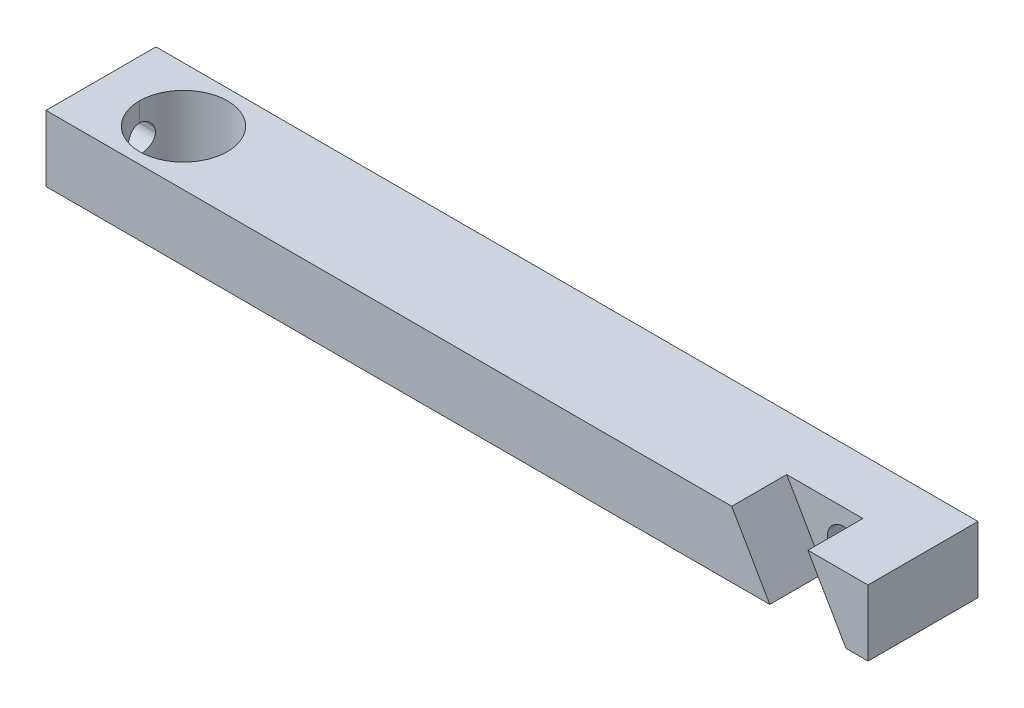
ISO-10303-21;
HEADER;
FILE_DESCRIPTION(('STEP AP214'),'2;1');
FILE_NAME('part.step','',(''),(''),'','','');
FILE_SCHEMA(('AUTOMOTIVE_DESIGN { 1 0 10303 214 1 1 1 1 }'));
ENDSEC;
DATA;
#1=APPLICATION_CONTEXT('core data for automotive mechanical design processes');
#2=APPLICATION_PROTOCOL_DEFINITION('international standard','automotive_design',2000,#1);
#3=PRODUCT_CONTEXT('',#1,'mechanical');
#4=PRODUCT('Part','Part','',(#3));
#5=PRODUCT_RELATED_PRODUCT_CATEGORY('part','',(#4));
#6=PRODUCT_DEFINITION_FORMATION('','',#4);
#7=PRODUCT_DEFINITION_CONTEXT('part definition',#1,'design');
#8=PRODUCT_DEFINITION('design','',#6,#7);
#9=PRODUCT_DEFINITION_SHAPE('','',#8);
#10=(LENGTH_UNIT() NAMED_UNIT(*) SI_UNIT(.MILLI.,.METRE.));
#11=(NAMED_UNIT(*) PLANE_ANGLE_UNIT() SI_UNIT($,.RADIAN.));
#12=(NAMED_UNIT(*) SI_UNIT($,.STERADIAN.) SOLID_ANGLE_UNIT());
#13=UNCERTAINTY_MEASURE_WITH_UNIT(LENGTH_MEASURE(1.E-05),#10,'distance_accuracy_value','');
#14=(GEOMETRIC_REPRESENTATION_CONTEXT(3) GLOBAL_UNCERTAINTY_ASSIGNED_CONTEXT((#13)) GLOBAL_UNIT_ASSIGNED_CONTEXT((#10,
#11,#12)) REPRESENTATION_CONTEXT('',''));
#15=CARTESIAN_POINT('',(0.,0.,0.));
#16=DIRECTION('',(0.,0.,1.));
#17=DIRECTION('',(1.,0.,0.));
#18=AXIS2_PLACEMENT_3D('',#15,#16,#17);
#19=CARTESIAN_POINT('',(-7.5,104.,0.));
#20=DIRECTION('',(-1.,0.,0.));
#21=DIRECTION('',(0.,0.,1.));
#22=AXIS2_PLACEMENT_3D('',#19,#20,#21);
#23=CYLINDRICAL_SURFACE('',#22,1.25);
#24=CARTESIAN_POINT('',(-3.79967103839265,104.,-1.25000000000006));
#25=CARTESIAN_POINT('',(-3.79967300010033,103.979341260387,-1.2499925708513));
#26=CARTESIAN_POINT('',(-3.79983884394613,103.95868174032,-1.24948985386808));
#27=CARTESIAN_POINT('',(-3.80049760968689,103.917548799479,-1.24748547221147));
#28=CARTESIAN_POINT('',(-3.80098843768822,103.897075032416,-1.24599020246324));
#29=CARTESIAN_POINT('',(-3.8022940161089,103.856313353297,-1.24200013711761));
#30=CARTESIAN_POINT('',(-3.80310753533987,103.836025031269,-1.23950914031696));
#31=CARTESIAN_POINT('',(-3.80505142907727,103.795634409207,-1.23352890468625));
#32=CARTESIAN_POINT('',(-3.80618145074405,103.775531927628,-1.23004077737704));
#33=CARTESIAN_POINT('',(-3.80874935096631,103.735512656155,-1.22206625232391));
#34=CARTESIAN_POINT('',(-3.81018771416554,103.715596210698,-1.21757828261102));
#35=CARTESIAN_POINT('',(-3.81336091401607,103.675948473343,-1.20760342483043));
#36=CARTESIAN_POINT('',(-3.81509698727552,103.656218331303,-1.20211236371523));
#37=CARTESIAN_POINT('',(-3.81885191390687,103.616942219289,-1.1901301356707));
#38=CARTESIAN_POINT('',(-3.82087262909034,103.597398447623,-1.18363235342774));
#39=CARTESIAN_POINT('',(-3.82518118032637,103.558494447965,-1.16963370611135));
#40=CARTESIAN_POINT('',(-3.82747134627348,103.539137666183,-1.16212399578106));
#41=CARTESIAN_POINT('',(-3.83223859227424,103.501093453789,-1.14630483516844));
#42=CARTESIAN_POINT('',(-3.83471266895294,103.482400479063,-1.13800780240955));
#43=CARTESIAN_POINT('',(-3.83984311093793,103.44555070139,-1.12057440414788));
#44=CARTESIAN_POINT('',(-3.84249850923293,103.42739169553,-1.11144241473838));
#45=CARTESIAN_POINT('',(-3.84797360685266,103.391609686806,-1.09233584826213));
#46=CARTESIAN_POINT('',(-3.85079286010734,103.373985410768,-1.0823635283374));
#47=CARTESIAN_POINT('',(-3.85657584993732,103.33927172477,-1.06157386987136));
#48=CARTESIAN_POINT('',(-3.85953955781485,103.322182209673,-1.05075669891546));
#49=CARTESIAN_POINT('',(-3.86559017597119,103.288536873349,-1.02827446889697));
#50=CARTESIAN_POINT('',(-3.86867734495555,103.271982320055,-1.01660758226925));
#51=CARTESIAN_POINT('',(-3.87495204760996,103.239405474988,-0.992422988343569));
#52=CARTESIAN_POINT('',(-3.8781399782165,103.223385987467,-0.979901608112887));
#53=CARTESIAN_POINT('',(-3.88459188088559,103.191877756538,-0.954004824991964));
#54=CARTESIAN_POINT('',(-3.88785622707684,103.176393466706,-0.940624099473873));
#55=CARTESIAN_POINT('',(-3.89443498392908,103.145953818187,-0.913005724083212));
#56=CARTESIAN_POINT('',(-3.89774957911118,103.131004618042,-0.898761336732451));
#57=CARTESIAN_POINT('',(-3.90434438423706,103.101887516861,-0.869664458525661));
#58=CARTESIAN_POINT('',(-3.90762468083549,103.087715430554,-0.854816175345123));
#59=CARTESIAN_POINT('',(-3.91412131112979,103.060207396074,-0.824555627320368));
#60=CARTESIAN_POINT('',(-3.91733793856455,103.046866034817,-0.809148351191602));
#61=CARTESIAN_POINT('',(-3.92368812600505,103.021018076423,-0.777770128703016));
#62=CARTESIAN_POINT('',(-3.92682203178346,103.008507488037,-0.761802541724582));
#63=CARTESIAN_POINT('',(-3.93298722793353,102.984319619556,-0.729303894259466));
#64=CARTESIAN_POINT('',(-3.93601879411345,102.972639986775,-0.712774637836716));
#65=CARTESIAN_POINT('',(-3.94195917123855,102.950112341238,-0.679153225803564));
#66=CARTESIAN_POINT('',(-3.94486806030892,102.939263795508,-0.662061441168576));
#67=CARTESIAN_POINT('',(-3.95054239439401,102.918396409674,-0.627315832002432));
#68=CARTESIAN_POINT('',(-3.95330759095591,102.908378989891,-0.609661113932547));
#69=CARTESIAN_POINT('',(-3.95867332617156,102.889172080618,-0.573790605432787));
#70=CARTESIAN_POINT('',(-3.96127316583386,102.879986044246,-0.555572861928062));
#71=CARTESIAN_POINT('',(-3.96628633104688,102.862439093146,-0.518578168673608));
#72=CARTESIAN_POINT('',(-3.96869839283406,102.854083679211,-0.499798440827462));
#73=CARTESIAN_POINT('',(-3.97331377317728,102.838199429806,-0.461681034696653));
#74=CARTESIAN_POINT('',(-3.97551518447484,102.830678063608,-0.442340010749169));
#75=CARTESIAN_POINT('',(-3.9796495131673,102.816646819788,-0.403446404549168));
#76=CARTESIAN_POINT('',(-3.98158448075439,102.810129166824,-0.383896849755154));
#77=CARTESIAN_POINT('',(-3.98517803286372,102.7981026555,-0.344591355548881));
#78=CARTESIAN_POINT('',(-3.98683817700261,102.792588085684,-0.324837307974689));
#79=CARTESIAN_POINT('',(-3.98987436007079,102.782565804875,-0.285127531885421));
#80=CARTESIAN_POINT('',(-3.99125137208636,102.77805464079,-0.265172750061727));
#81=CARTESIAN_POINT('',(-3.99371359822312,102.770036830846,-0.22506639917594));
#82=CARTESIAN_POINT('',(-3.99479911747207,102.766529134327,-0.204915058953864));
#83=CARTESIAN_POINT('',(-3.99667079219043,102.7605156922,-0.164420403740985));
#84=CARTESIAN_POINT('',(-3.99745652150937,102.758011372637,-0.1440768572851));
#85=CARTESIAN_POINT('',(-3.99872086524806,102.754002702518,-0.103202748122406));
#86=CARTESIAN_POINT('',(-3.99919827980915,102.752502257903,-0.0826717663878889));
#87=CARTESIAN_POINT('',(-3.99983913090932,102.750496928101,-0.0414271212798195));
#88=CARTESIAN_POINT('',(-4.0000005798885,102.74999834453,-0.0207131196596859));
#89=CARTESIAN_POINT('',(-4.,102.75,0.));
#90=B_SPLINE_CURVE_WITH_KNOTS('',3,(#24,#25,#26,#27,#28,#29,#30,#31,#32,#33,#34,#35,#36,#37,#38,
#39,#40,#41,#42,#43,#44,#45,#46,#47,#48,#49,#50,#51,#52,#53,#54,#55,#56,#57,#58,#59,#60,#61,#62,
#63,#64,#65,#66,#67,#68,#69,#70,#71,#72,#73,#74,#75,#76,#77,#78,#79,#80,#81,#82,#83,#84,#85,#86,
#87,#88,#89),.UNSPECIFIED.,.F.,.F.,(4,2,2,2,2,2,2,2,2,2,2,2,2,2,2,2,2,2,2,2,2,2,2,2,2,2,2,2,2,2,
2,2,4),(0.,0.0619710973555212,0.123546746614968,0.18488968718947,0.246164512469214,
0.307536363587487,0.369169601372799,0.431226509315285,0.493866077542971,0.555644271127091,
0.61711544951729,0.678426479518832,0.739725378546247,0.801160251148691,0.862878222407353,
0.92502440618229,0.987740943338481,1.0500774614115,1.11195251752592,1.17350482506236,
1.23487528573206,1.29620605438249,1.35763956118797,1.4193175243639,1.48137998729444,
1.54395969407194,1.60602717210283,1.66772935452112,1.72921579333029,1.79063761644501,
1.85214642805721,1.91389319161533,1.97602713616613),.UNSPECIFIED.);
#91=CARTESIAN_POINT('',(-3.79967103839265,104.,-1.25000000000007));
#92=VERTEX_POINT('',#91);
#93=CARTESIAN_POINT('',(-4.,102.75,0.));
#94=VERTEX_POINT('',#93);
#95=EDGE_CURVE('E43',#92,#94,#90,.T.);
#96=ORIENTED_EDGE('',*,*,#95,.F.);
#97=DIRECTION('',(-1.,0.,0.));
#98=VECTOR('',#97,1.);
#99=CARTESIAN_POINT('',(-7.5,104.,-1.25));
#100=LINE('',#99,#98);
#101=CARTESIAN_POINT('',(-7.5,104.,-1.24999999999999));
#102=VERTEX_POINT('',#101);
#103=EDGE_CURVE('E11',#92,#102,#100,.T.);
#104=ORIENTED_EDGE('',*,*,#103,.T.);
#105=CARTESIAN_POINT('',(-7.5,104.,0.));
#106=DIRECTION('',(-1.,0.,0.));
#107=DIRECTION('',(0.,0.,1.));
#108=AXIS2_PLACEMENT_3D('',#105,#106,#107);
#109=CIRCLE('',#108,1.24999999999999);
#110=CARTESIAN_POINT('',(-7.5,104.,1.24999999999999));
#111=VERTEX_POINT('',#110);
#112=EDGE_CURVE('E29',#102,#111,#109,.T.);
#113=ORIENTED_EDGE('',*,*,#112,.T.);
#114=DIRECTION('',(-1.,0.,0.));
#115=VECTOR('',#114,1.);
#116=CARTESIAN_POINT('',(-7.5,104.,1.25));
#117=LINE('',#116,#115);
#118=CARTESIAN_POINT('',(-3.79967103839267,104.,1.25));
#119=VERTEX_POINT('',#118);
#120=EDGE_CURVE('E233',#119,#111,#117,.T.);
#121=ORIENTED_EDGE('',*,*,#120,.F.);
#122=CARTESIAN_POINT('',(-4.,102.75,0.));
#123=CARTESIAN_POINT('',(-4.00000057915074,102.749998344257,0.0207048785798419));
#124=CARTESIAN_POINT('',(-3.99983925890899,102.750496741512,0.0414106300271996));
#125=CARTESIAN_POINT('',(-3.99919890104543,102.752501211791,0.0826399529851797));
#126=CARTESIAN_POINT('',(-3.99872183265545,102.754001039685,0.103163859662953));
#127=CARTESIAN_POINT('',(-3.99745835992292,102.758007990347,0.144024998138695));
#128=CARTESIAN_POINT('',(-3.99667313828662,102.760511262628,0.16436264296939));
#129=CARTESIAN_POINT('',(-3.99480260002081,102.766522124285,0.204846681156299));
#130=CARTESIAN_POINT('',(-3.99371769375024,102.770028340558,0.224993297347518));
#131=CARTESIAN_POINT('',(-3.99125675850008,102.778042712528,0.265091386632119));
#132=CARTESIAN_POINT('',(-3.9898804100267,102.782551968084,0.285042620216591));
#133=CARTESIAN_POINT('',(-3.98684556248205,102.79256993853,0.32474649464368));
#134=CARTESIAN_POINT('',(-3.98518607739056,102.798082150821,0.344498176883417));
#135=CARTESIAN_POINT('',(-3.9815938008345,102.810103534313,0.383800103896069));
#136=CARTESIAN_POINT('',(-3.97965943819949,102.81661845604,0.403348444401238));
#137=CARTESIAN_POINT('',(-3.97552621028548,102.830643547254,0.442240891664556));
#138=CARTESIAN_POINT('',(-3.97332528437346,102.838161522834,0.461581959965306));
#139=CARTESIAN_POINT('',(-3.96870913004865,102.854045030444,0.499713719109801));
#140=CARTESIAN_POINT('',(-3.96629563944903,102.862403756735,0.518507456928543));
#141=CARTESIAN_POINT('',(-3.96127916384526,102.879960293913,0.555530601486737));
#142=CARTESIAN_POINT('',(-3.95867742745063,102.889152662946,0.573762755745934));
#143=CARTESIAN_POINT('',(-3.9533074274468,102.908374906974,0.609662637221761));
#144=CARTESIAN_POINT('',(-3.95053984788426,102.918401400128,0.627332277116502));
#145=CARTESIAN_POINT('',(-3.94486027654129,102.939289664772,0.662108251146952));
#146=CARTESIAN_POINT('',(-3.94194851912861,102.950150095525,0.679215428833789));
#147=CARTESIAN_POINT('',(-3.93600193138875,102.972704220998,0.71286815320798));
#148=CARTESIAN_POINT('',(-3.9329670104167,102.984398534406,0.729413269157902));
#149=CARTESIAN_POINT('',(-3.92679462452557,103.008618453631,0.761944181165872));
#150=CARTESIAN_POINT('',(-3.92365687340471,103.021146501259,0.777928104209723));
#151=CARTESIAN_POINT('',(-3.91729853015467,103.047032140216,0.80933947462837));
#152=CARTESIAN_POINT('',(-3.91407758448763,103.06039381312,0.824763485161521));
#153=CARTESIAN_POINT('',(-3.90757179053068,103.087944945534,0.855058252121001));
#154=CARTESIAN_POINT('',(-3.90428664309461,103.102139904843,0.869923937619056));
#155=CARTESIAN_POINT('',(-3.89768896572086,103.131274852468,0.899023942271366));
#156=CARTESIAN_POINT('',(-3.89437637877022,103.146217624074,0.913255462043157));
#157=CARTESIAN_POINT('',(-3.8878016406159,103.176645766547,0.940849521441264));
#158=CARTESIAN_POINT('',(-3.88453930377461,103.192125046789,0.954218726770277));
#159=CARTESIAN_POINT('',(-3.87809128482094,103.22362431719,0.98009416237248));
#160=CARTESIAN_POINT('',(-3.87490523264414,103.239639922596,0.992605635574342));
#161=CARTESIAN_POINT('',(-3.86863410044945,103.272210140961,1.01677202921137));
#162=CARTESIAN_POINT('',(-3.86554863168697,103.28876201457,1.02843053933297));
#163=CARTESIAN_POINT('',(-3.85950116374318,103.322403115309,1.05089763549408));
#164=CARTESIAN_POINT('',(-3.85653891768103,103.339491134398,1.06170796367052));
#165=CARTESIAN_POINT('',(-3.85075854172867,103.374202953664,1.08248556122416));
#166=CARTESIAN_POINT('',(-3.84794045517928,103.391826912458,1.09245257764621));
#167=CARTESIAN_POINT('',(-3.84246735691553,103.427609453756,1.11155007310062));
#168=CARTESIAN_POINT('',(-3.83981280786242,103.445769355737,1.12067821175743));
#169=CARTESIAN_POINT('',(-3.83468360135636,103.482621964943,1.1381057237635));
#170=CARTESIAN_POINT('',(-3.83220992797735,103.501316913071,1.14640064375755));
#171=CARTESIAN_POINT('',(-3.82744527393973,103.539351101389,1.16220980341513));
#172=CARTESIAN_POINT('',(-3.82515713800557,103.558695590142,1.16971228405366));
#173=CARTESIAN_POINT('',(-3.82085249734022,103.59757589154,1.18369729771453));
#174=CARTESIAN_POINT('',(-3.81883367615195,103.61710828012,1.19018862196511));
#175=CARTESIAN_POINT('',(-3.81508226492283,103.656362382743,1.20215905475903));
#176=CARTESIAN_POINT('',(-3.81334782886811,103.676081918498,1.20764472119075));
#177=CARTESIAN_POINT('',(-3.81017762816263,103.715709238967,1.21760982345941));
#178=CARTESIAN_POINT('',(-3.80874064344509,103.735615889859,1.22209337599837));
#179=CARTESIAN_POINT('',(-3.80617519718752,103.775616362469,1.23006011430962));
#180=CARTESIAN_POINT('',(-3.80504626770916,103.795709851818,1.23354481775234));
#181=CARTESIAN_POINT('',(-3.80310424137329,103.836083286633,1.23951923944831));
#182=CARTESIAN_POINT('',(-3.80229151344765,103.856363421809,1.24200779553206));
#183=CARTESIAN_POINT('',(-3.80098718888008,103.897109526707,1.24599400849053));
#184=CARTESIAN_POINT('',(-3.80049683823964,103.917575911071,1.24748782092308));
#185=CARTESIAN_POINT('',(-3.79983869622727,103.958694893648,1.24949030291479));
#186=CARTESIAN_POINT('',(-3.79967301166959,103.979347840083,1.24999253811568));
#187=CARTESIAN_POINT('',(-3.79967103839267,104.,1.25));
#188=B_SPLINE_CURVE_WITH_KNOTS('',3,(#122,#123,#124,#125,#126,#127,#128,#129,#130,#131,#132,
#133,#134,#135,#136,#137,#138,#139,#140,#141,#142,#143,#144,#145,#146,#147,#148,#149,#150,#151,
#152,#153,#154,#155,#156,#157,#158,#159,#160,#161,#162,#163,#164,#165,#166,#167,#168,#169,#170,
#171,#172,#173,#174,#175,#176,#177,#178,#179,#180,#181,#182,#183,#184,#185,#186,#187),
.UNSPECIFIED.,.F.,.F.,(4,2,2,2,2,2,2,2,2,2,2,2,2,2,2,2,2,2,2,2,2,2,2,2,2,2,2,2,2,2,2,2,4),(0.,
0.062109210957399,0.123834669125424,0.185325503345825,0.246732551867128,0.308207269695807,
0.369900613472095,0.431961944522592,0.49453798921703,0.55664300804142,0.618368367245765,
0.679854644174704,0.741244058862639,0.802679504259094,0.864303553318625,0.926257477125953,
0.988680307350655,1.05135582667553,1.11346750823772,1.17515747853308,1.23657079265242,
1.29785447084032,1.35915646665314,1.42062460192073,1.48240550642887,1.54500245884579,
1.60702048579723,1.66861846925896,1.7299585558482,1.79120494101275,1.85252257333412,
1.9140758289117,1.97602720852448),.UNSPECIFIED.);
#189=EDGE_CURVE('E146',#94,#119,#188,.T.);
#190=ORIENTED_EDGE('',*,*,#189,.F.);
#191=EDGE_LOOP('',(#96,#104,#113,#121,#190));
#192=FACE_BOUND('',#191,.T.);
#193=ADVANCED_FACE('F16',(#192),#23,.F.);
#194=CARTESIAN_POINT('',(0.,101.,0.));
#195=DIRECTION('',(0.,1.,0.));
#196=DIRECTION('',(-1.,0.,0.));
#197=AXIS2_PLACEMENT_3D('',#194,#195,#196);
#198=CYLINDRICAL_SURFACE('',#197,4.);
#199=CARTESIAN_POINT('',(0.,101.,0.));
#200=DIRECTION('',(0.,1.,0.));
#201=DIRECTION('',(-1.,0.,0.));
#202=AXIS2_PLACEMENT_3D('',#199,#200,#201);
#203=CIRCLE('',#202,4.);
#204=CARTESIAN_POINT('',(4.,101.,0.));
#205=VERTEX_POINT('',#204);
#206=CARTESIAN_POINT('',(-4.,101.,0.));
#207=VERTEX_POINT('',#206);
#208=EDGE_CURVE('E202',#205,#207,#203,.T.);
#209=ORIENTED_EDGE('',*,*,#208,.F.);
#210=DIRECTION('',(0.,1.,0.));
#211=VECTOR('',#210,1.);
#212=CARTESIAN_POINT('',(4.,101.,0.));
#213=LINE('',#212,#211);
#214=CARTESIAN_POINT('',(4.,107.,0.));
#215=VERTEX_POINT('',#214);
#216=EDGE_CURVE('E183',#205,#215,#213,.T.);
#217=ORIENTED_EDGE('',*,*,#216,.T.);
#218=CARTESIAN_POINT('',(0.,107.,0.));
#219=DIRECTION('',(0.,1.,0.));
#220=DIRECTION('',(-1.,0.,0.));
#221=AXIS2_PLACEMENT_3D('',#218,#219,#220);
#222=CIRCLE('',#221,4.);
#223=CARTESIAN_POINT('',(-4.,107.,0.));
#224=VERTEX_POINT('',#223);
#225=EDGE_CURVE('E187',#215,#224,#222,.T.);
#226=ORIENTED_EDGE('',*,*,#225,.T.);
#227=DIRECTION('',(0.,1.,0.));
#228=VECTOR('',#227,1.);
#229=CARTESIAN_POINT('',(-4.,101.,0.));
#230=LINE('',#229,#228);
#231=CARTESIAN_POINT('',(-4.,105.25,0.));
#232=VERTEX_POINT('',#231);
#233=EDGE_CURVE('E232',#232,#224,#230,.T.);
#234=ORIENTED_EDGE('',*,*,#233,.F.);
#235=CARTESIAN_POINT('',(-4.,105.25,0.));
#236=CARTESIAN_POINT('',(-4.00000057515368,105.2500016449,-0.0206688774023886));
#237=CARTESIAN_POINT('',(-3.99983981735444,105.249504920156,-0.0413386200093546));
#238=CARTESIAN_POINT('',(-3.99920167512204,105.247507217359,-0.0824968872504972));
#239=CARTESIAN_POINT('',(-3.99872624600828,105.246012440548,-0.102985744138052));
#240=CARTESIAN_POINT('',(-3.99746708415262,105.242019011928,-0.143777766644425));
#241=CARTESIAN_POINT('',(-3.99668452563482,105.239524182774,-0.164081341624119));
#242=CARTESIAN_POINT('',(-3.99482028187261,105.233533607044,-0.204498246187474));
#243=CARTESIAN_POINT('',(-3.99373900379713,105.23003922268,-0.224611796462215));
#244=CARTESIAN_POINT('',(-3.99128623135769,105.222051898089,-0.26464477681801));
#245=CARTESIAN_POINT('',(-3.98991441917153,105.217557864048,-0.284563969118376));
#246=CARTESIAN_POINT('',(-3.98688948939738,105.20757370203,-0.324204795923331));
#247=CARTESIAN_POINT('',(-3.9852353916839,105.202080098887,-0.343925479589109));
#248=CARTESIAN_POINT('',(-3.98165467484197,105.190099286611,-0.383166455199586));
#249=CARTESIAN_POINT('',(-3.97972649385003,105.183606363973,-0.402684858509608));
#250=CARTESIAN_POINT('',(-3.97560635660056,105.169628596535,-0.441518473289956));
#251=CARTESIAN_POINT('',(-3.97341235151522,105.162135995355,-0.460830671076105));
#252=CARTESIAN_POINT('',(-3.96880636256937,105.146291622069,-0.49894113040707));
#253=CARTESIAN_POINT('',(-3.96639570138892,105.137945025337,-0.517741704687289));
#254=CARTESIAN_POINT('',(-3.96138451783742,105.120412239336,-0.554779068253686));
#255=CARTESIAN_POINT('',(-3.95878524552297,105.111231491614,-0.573018600415988));
#256=CARTESIAN_POINT('',(-3.95341979456037,105.092031966339,-0.608933771095527));
#257=CARTESIAN_POINT('',(-3.95065430069912,105.082016569122,-0.626611318552086));
#258=CARTESIAN_POINT('',(-3.94497851062284,105.061149978301,-0.661403630693449));
#259=CARTESIAN_POINT('',(-3.94206844873843,105.05030012257,-0.678519235949727));
#260=CARTESIAN_POINT('',(-3.93612485237823,105.027766629406,-0.71218932821452));
#261=CARTESIAN_POINT('',(-3.93309122639999,105.016082369068,-0.728743382120859));
#262=CARTESIAN_POINT('',(-3.92692102295275,104.991882039236,-0.76129267206826));
#263=CARTESIAN_POINT('',(-3.92378415759067,104.979363522391,-0.777286033199139));
#264=CARTESIAN_POINT('',(-3.91742717085659,104.953496432002,-0.808716775779983));
#265=CARTESIAN_POINT('',(-3.91420669343169,104.940143770105,-0.824150718845297));
#266=CARTESIAN_POINT('',(-3.90770141848542,104.912610138371,-0.854465825676291));
#267=CARTESIAN_POINT('',(-3.9044163185436,104.898423660741,-0.869341917100502));
#268=CARTESIAN_POINT('',(-3.89781493040605,104.869290254876,-0.898478079954498));
#269=CARTESIAN_POINT('',(-3.89449856854772,104.854339830468,-0.912734639116527));
#270=CARTESIAN_POINT('',(-3.88791602236575,104.823894818176,-0.940377108847567));
#271=CARTESIAN_POINT('',(-3.88464965517399,104.808406347636,-0.9537697071793));
#272=CARTESIAN_POINT('',(-3.87819341546376,104.776887127842,-0.979690266237744));
#273=CARTESIAN_POINT('',(-3.87500317382161,104.760860782193,-0.992223487156619));
#274=CARTESIAN_POINT('',(-3.86872359063677,104.728267526105,-1.01643173471082));
#275=CARTESIAN_POINT('',(-3.86563386035757,104.711703365996,-1.02811036207734));
#276=CARTESIAN_POINT('',(-3.85957787891014,104.67803614207,-1.05061607109927));
#277=CARTESIAN_POINT('',(-3.85661138080658,104.660934289915,-1.06144489861287));
#278=CARTESIAN_POINT('',(-3.85082258443116,104.626193262063,-1.08225789597499));
#279=CARTESIAN_POINT('',(-3.848000330205,104.608553924837,-1.09224180842703));
#280=CARTESIAN_POINT('',(-3.84251904783971,104.572739090042,-1.11137151898667));
#281=CARTESIAN_POINT('',(-3.83986048454156,104.554562264656,-1.12051496362895));
#282=CARTESIAN_POINT('',(-3.8347234599874,104.517674279181,-1.13797153862872));
#283=CARTESIAN_POINT('',(-3.83224598701125,104.498960865737,-1.14628019384262));
#284=CARTESIAN_POINT('',(-3.82747524272723,104.460898164674,-1.16211117050042));
#285=CARTESIAN_POINT('',(-3.8251847093606,104.441543820395,-1.16962216948491));
#286=CARTESIAN_POINT('',(-3.82087552033207,104.402643525678,-1.18362302965753));
#287=CARTESIAN_POINT('',(-3.81885454324838,104.383101009681,-1.19012170346168));
#288=CARTESIAN_POINT('',(-3.81509910037451,104.343826377311,-1.20210566214329));
#289=CARTESIAN_POINT('',(-3.81336278416123,104.32409644613,-1.20759752184095));
#290=CARTESIAN_POINT('',(-3.81018913195787,104.284448062431,-1.21757384995546));
#291=CARTESIAN_POINT('',(-3.80875057257134,104.264530747631,-1.22206244682078));
#292=CARTESIAN_POINT('',(-3.80618230833486,104.224508678103,-1.23003812600256));
#293=CARTESIAN_POINT('',(-3.80505213374302,104.204404257242,-1.23352673195217));
#294=CARTESIAN_POINT('',(-3.80310796514059,104.16400869246,-1.2395078229266));
#295=CARTESIAN_POINT('',(-3.80229434009943,104.143717358695,-1.24199914561745));
#296=CARTESIAN_POINT('',(-3.80098858117805,104.102948591545,-1.24598976535187));
#297=CARTESIAN_POINT('',(-3.80049769534204,104.082470742606,-1.24748521158893));
#298=CARTESIAN_POINT('',(-3.79983884586663,104.041328565083,-1.24948984790501));
#299=CARTESIAN_POINT('',(-3.79967299306323,104.02066388743,-1.24999259131155));
#300=CARTESIAN_POINT('',(-3.79967103839265,104.,-1.25000000000006));
#301=B_SPLINE_CURVE_WITH_KNOTS('',3,(#235,#236,#237,#238,#239,#240,#241,#242,#243,#244,#245,
#246,#247,#248,#249,#250,#251,#252,#253,#254,#255,#256,#257,#258,#259,#260,#261,#262,#263,#264,
#265,#266,#267,#268,#269,#270,#271,#272,#273,#274,#275,#276,#277,#278,#279,#280,#281,#282,#283,
#284,#285,#286,#287,#288,#289,#290,#291,#292,#293,#294,#295,#296,#297,#298,#299,#300),
.UNSPECIFIED.,.F.,.F.,(4,2,2,2,2,2,2,2,2,2,2,2,2,2,2,2,2,2,2,2,2,2,2,2,2,2,2,2,2,2,2,2,4),(0.,
0.0620012299162425,0.123620765917424,0.185006976401202,0.246309923915363,0.307680281802602,
0.369268228663298,0.431222360801037,0.493688661312325,0.555796612140298,0.617525080649956,
0.679014682975814,0.740407676814119,0.801846991148747,0.863475232892922,0.92543370463955,
0.987861466831144,1.05060627968622,1.11278570372892,1.17454231404769,1.23602162808882,
1.29737113715838,1.35873926907678,1.4202743174529,1.48212337577794,1.54475766397404,
1.60681189260956,1.66844520733399,1.72982002877862,1.79110083345873,1.85245285442693,
1.91404075183825,1.97602730633556),.UNSPECIFIED.);
#302=EDGE_CURVE('E224',#232,#92,#301,.T.);
#303=ORIENTED_EDGE('',*,*,#302,.T.);
#304=ORIENTED_EDGE('',*,*,#95,.T.);
#305=DIRECTION('',(0.,1.,0.));
#306=VECTOR('',#305,1.);
#307=CARTESIAN_POINT('',(-4.,101.,0.));
#308=LINE('',#307,#306);
#309=EDGE_CURVE('E136',#207,#94,#308,.T.);
#310=ORIENTED_EDGE('',*,*,#309,.F.);
#311=EDGE_LOOP('',(#209,#217,#226,#234,#303,#304,#310));
#312=FACE_BOUND('',#311,.T.);
#313=ADVANCED_FACE('F253',(#312),#198,.F.);
#314=CARTESIAN_POINT('',(60.0444279957211,104.,-5.));
#315=DIRECTION('',(0.,0.,1.));
#316=DIRECTION('',(1.,0.,0.));
#317=AXIS2_PLACEMENT_3D('',#314,#315,#316);
#318=CYLINDRICAL_SURFACE('',#317,1.5);
#319=CARTESIAN_POINT('',(60.0444279957211,104.,-5.));
#320=DIRECTION('',(0.,0.,1.));
#321=DIRECTION('',(1.,0.,0.));
#322=AXIS2_PLACEMENT_3D('',#319,#320,#321);
#323=CIRCLE('',#322,1.5);
#324=CARTESIAN_POINT('',(58.5444279957211,104.,-5.));
#325=VERTEX_POINT('',#324);
#326=CARTESIAN_POINT('',(61.5444279957211,104.,-5.));
#327=VERTEX_POINT('',#326);
#328=EDGE_CURVE('E127',#325,#327,#323,.T.);
#329=ORIENTED_EDGE('',*,*,#328,.F.);
#330=DIRECTION('',(0.,0.,1.));
#331=VECTOR('',#330,1.);
#332=CARTESIAN_POINT('',(58.5444279957211,104.,-5.));
#333=LINE('',#332,#331);
#334=CARTESIAN_POINT('',(58.5444279957211,104.,0.));
#335=VERTEX_POINT('',#334);
#336=EDGE_CURVE('E121',#325,#335,#333,.T.);
#337=ORIENTED_EDGE('',*,*,#336,.T.);
#338=CARTESIAN_POINT('',(60.0444279957211,104.,0.));
#339=DIRECTION('',(0.,0.,1.));
#340=DIRECTION('',(1.,0.,0.));
#341=AXIS2_PLACEMENT_3D('',#338,#339,#340);
#342=CIRCLE('',#341,1.5);
#343=CARTESIAN_POINT('',(61.5444279957211,104.,0.));
#344=VERTEX_POINT('',#343);
#345=EDGE_CURVE('E114',#335,#344,#342,.T.);
#346=ORIENTED_EDGE('',*,*,#345,.T.);
#347=DIRECTION('',(0.,0.,1.));
#348=VECTOR('',#347,1.);
#349=CARTESIAN_POINT('',(61.5444279957211,104.,-5.));
#350=LINE('',#349,#348);
#351=EDGE_CURVE('E134',#327,#344,#350,.T.);
#352=ORIENTED_EDGE('',*,*,#351,.F.);
#353=EDGE_LOOP('',(#329,#337,#346,#352));
#354=FACE_BOUND('',#353,.T.);
#355=ADVANCED_FACE('F125',(#354),#318,.F.);
#356=CARTESIAN_POINT('',(-7.5,101.,5.));
#357=DIRECTION('',(0.,1.,0.));
#358=DIRECTION('',(1.,0.,0.));
#359=AXIS2_PLACEMENT_3D('',#356,#357,#358);
#360=PLANE('',#359);
#361=DIRECTION('',(0.,0.,-1.));
#362=VECTOR('',#361,1.);
#363=CARTESIAN_POINT('',(58.3123771881522,101.,5.));
#364=LINE('',#363,#362);
#365=CARTESIAN_POINT('',(58.3123771881522,101.,5.));
#366=VERTEX_POINT('',#365);
#367=CARTESIAN_POINT('',(58.3123771881522,101.,0.));
#368=VERTEX_POINT('',#367);
#369=EDGE_CURVE('E158',#366,#368,#364,.T.);
#370=ORIENTED_EDGE('',*,*,#369,.F.);
#371=DIRECTION('',(1.,0.,0.));
#372=VECTOR('',#371,1.);
#373=CARTESIAN_POINT('',(-7.5,101.,5.));
#374=LINE('',#373,#372);
#375=CARTESIAN_POINT('',(-7.5,101.,5.));
#376=VERTEX_POINT('',#375);
#377=EDGE_CURVE('E156',#376,#366,#374,.T.);
#378=ORIENTED_EDGE('',*,*,#377,.F.);
#379=DIRECTION('',(0.,0.,-1.));
#380=VECTOR('',#379,1.);
#381=CARTESIAN_POINT('',(-7.5,101.,5.));
#382=LINE('',#381,#380);
#383=CARTESIAN_POINT('',(-7.5,101.,-5.));
#384=VERTEX_POINT('',#383);
#385=EDGE_CURVE('E122',#376,#384,#382,.T.);
#386=ORIENTED_EDGE('',*,*,#385,.T.);
#387=DIRECTION('',(1.,0.,0.));
#388=VECTOR('',#387,1.);
#389=CARTESIAN_POINT('',(-7.5,101.,-5.));
#390=LINE('',#389,#388);
#391=CARTESIAN_POINT('',(67.2405804184278,101.,-5.));
#392=VERTEX_POINT('',#391);
#393=EDGE_CURVE('E217',#384,#392,#390,.T.);
#394=ORIENTED_EDGE('',*,*,#393,.T.);
#395=DIRECTION('',(0.,0.,-1.));
#396=VECTOR('',#395,1.);
#397=CARTESIAN_POINT('',(67.2405804184278,101.,5.));
#398=LINE('',#397,#396);
#399=CARTESIAN_POINT('',(67.2405804184278,101.,5.));
#400=VERTEX_POINT('',#399);
#401=EDGE_CURVE('E193',#400,#392,#398,.T.);
#402=ORIENTED_EDGE('',*,*,#401,.F.);
#403=DIRECTION('',(1.,0.,0.));
#404=VECTOR('',#403,1.);
#405=CARTESIAN_POINT('',(-7.5,101.,5.));
#406=LINE('',#405,#404);
#407=CARTESIAN_POINT('',(65.2405804184278,101.,5.));
#408=VERTEX_POINT('',#407);
#409=EDGE_CURVE('E152',#408,#400,#406,.T.);
#410=ORIENTED_EDGE('',*,*,#409,.F.);
#411=DIRECTION('',(0.,0.,-1.));
#412=VECTOR('',#411,1.);
#413=CARTESIAN_POINT('',(65.2405804184278,101.,5.));
#414=LINE('',#413,#412);
#415=CARTESIAN_POINT('',(65.2405804184278,101.,0.));
#416=VERTEX_POINT('',#415);
#417=EDGE_CURVE('E213',#408,#416,#414,.T.);
#418=ORIENTED_EDGE('',*,*,#417,.T.);
#419=DIRECTION('',(1.,0.,0.));
#420=VECTOR('',#419,1.);
#421=CARTESIAN_POINT('',(65.2405804184278,101.,0.));
#422=LINE('',#421,#420);
#423=EDGE_CURVE('E177',#368,#416,#422,.T.);
#424=ORIENTED_EDGE('',*,*,#423,.F.);
#425=EDGE_LOOP('',(#370,#378,#386,#394,#402,#410,#418,#424));
#426=FACE_BOUND('',#425,.T.);
#427=CARTESIAN_POINT('',(0.,101.,0.));
#428=DIRECTION('',(0.,1.,0.));
#429=DIRECTION('',(-1.,0.,0.));
#430=AXIS2_PLACEMENT_3D('',#427,#428,#429);
#431=CIRCLE('',#430,4.);
#432=EDGE_CURVE('E205',#207,#205,#431,.T.);
#433=ORIENTED_EDGE('',*,*,#432,.T.);
#434=ORIENTED_EDGE('',*,*,#208,.T.);
#435=EDGE_LOOP('',(#433,#434));
#436=FACE_BOUND('',#435,.T.);
#437=ADVANCED_FACE('F374',(#426,#436),#360,.F.);
#438=CARTESIAN_POINT('',(-7.5,107.,5.));
#439=DIRECTION('',(0.,-1.,0.));
#440=DIRECTION('',(0.,0.,-1.));
#441=AXIS2_PLACEMENT_3D('',#438,#439,#440);
#442=PLANE('',#441);
#443=DIRECTION('',(0.,0.,-1.));
#444=VECTOR('',#443,1.);
#445=CARTESIAN_POINT('',(54.8482755730146,107.,5.));
#446=LINE('',#445,#444);
#447=CARTESIAN_POINT('',(54.8482755730146,107.,5.));
#448=VERTEX_POINT('',#447);
#449=CARTESIAN_POINT('',(54.8482755730146,107.,0.));
#450=VERTEX_POINT('',#449);
#451=EDGE_CURVE('E198',#448,#450,#446,.T.);
#452=ORIENTED_EDGE('',*,*,#451,.T.);
#453=DIRECTION('',(-1.,0.,0.));
#454=VECTOR('',#453,1.);
#455=CARTESIAN_POINT('',(54.8482755730146,107.,0.));
#456=LINE('',#455,#454);
#457=CARTESIAN_POINT('',(61.7764788032901,107.,0.));
#458=VERTEX_POINT('',#457);
#459=EDGE_CURVE('E143',#458,#450,#456,.T.);
#460=ORIENTED_EDGE('',*,*,#459,.F.);
#461=DIRECTION('',(0.,0.,-1.));
#462=VECTOR('',#461,1.);
#463=CARTESIAN_POINT('',(61.7764788032901,107.,5.));
#464=LINE('',#463,#462);
#465=CARTESIAN_POINT('',(61.7764788032901,107.,5.));
#466=VERTEX_POINT('',#465);
#467=EDGE_CURVE('E397',#466,#458,#464,.T.);
#468=ORIENTED_EDGE('',*,*,#467,.F.);
#469=DIRECTION('',(-1.,0.,0.));
#470=VECTOR('',#469,1.);
#471=CARTESIAN_POINT('',(-7.5,107.,5.));
#472=LINE('',#471,#470);
#473=CARTESIAN_POINT('',(67.2405804184278,107.,5.));
#474=VERTEX_POINT('',#473);
#475=EDGE_CURVE('E237',#474,#466,#472,.T.);
#476=ORIENTED_EDGE('',*,*,#475,.F.);
#477=DIRECTION('',(0.,0.,-1.));
#478=VECTOR('',#477,1.);
#479=CARTESIAN_POINT('',(67.2405804184278,107.,5.));
#480=LINE('',#479,#478);
#481=CARTESIAN_POINT('',(67.2405804184278,107.,-5.));
#482=VERTEX_POINT('',#481);
#483=EDGE_CURVE('E176',#474,#482,#480,.T.);
#484=ORIENTED_EDGE('',*,*,#483,.T.);
#485=DIRECTION('',(-1.,0.,0.));
#486=VECTOR('',#485,1.);
#487=CARTESIAN_POINT('',(-7.5,107.,-5.));
#488=LINE('',#487,#486);
#489=CARTESIAN_POINT('',(-7.5,107.,-5.));
#490=VERTEX_POINT('',#489);
#491=EDGE_CURVE('E171',#482,#490,#488,.T.);
#492=ORIENTED_EDGE('',*,*,#491,.T.);
#493=DIRECTION('',(0.,0.,-1.));
#494=VECTOR('',#493,1.);
#495=CARTESIAN_POINT('',(-7.5,107.,5.));
#496=LINE('',#495,#494);
#497=CARTESIAN_POINT('',(-7.5,107.,5.));
#498=VERTEX_POINT('',#497);
#499=EDGE_CURVE('E192',#498,#490,#496,.T.);
#500=ORIENTED_EDGE('',*,*,#499,.F.);
#501=DIRECTION('',(-1.,0.,0.));
#502=VECTOR('',#501,1.);
#503=CARTESIAN_POINT('',(-7.5,107.,5.));
#504=LINE('',#503,#502);
#505=EDGE_CURVE('E167',#448,#498,#504,.T.);
#506=ORIENTED_EDGE('',*,*,#505,.F.);
#507=EDGE_LOOP('',(#452,#460,#468,#476,#484,#492,#500,#506));
#508=FACE_BOUND('',#507,.T.);
#509=CARTESIAN_POINT('',(0.,107.,0.));
#510=DIRECTION('',(0.,1.,0.));
#511=DIRECTION('',(-1.,0.,0.));
#512=AXIS2_PLACEMENT_3D('',#509,#510,#511);
#513=CIRCLE('',#512,4.);
#514=EDGE_CURVE('E228',#224,#215,#513,.T.);
#515=ORIENTED_EDGE('',*,*,#514,.F.);
#516=ORIENTED_EDGE('',*,*,#225,.F.);
#517=EDGE_LOOP('',(#515,#516));
#518=FACE_BOUND('',#517,.T.);
#519=ADVANCED_FACE('F289',(#508,#518),#442,.F.);
#520=CARTESIAN_POINT('',(0.,0.,5.));
#521=DIRECTION('',(0.,0.,-1.));
#522=DIRECTION('',(0.,-1.,0.));
#523=AXIS2_PLACEMENT_3D('',#520,#521,#522);
#524=PLANE('',#523);
#525=DIRECTION('',(0.499999999999979,-0.866025403784451,0.));
#526=VECTOR('',#525,1.);
#527=CARTESIAN_POINT('',(58.3123771881522,101.,5.));
#528=LINE('',#527,#526);
#529=EDGE_CURVE('E162',#448,#366,#528,.T.);
#530=ORIENTED_EDGE('',*,*,#529,.F.);
#531=ORIENTED_EDGE('',*,*,#505,.T.);
#532=DIRECTION('',(0.,-1.,0.));
#533=VECTOR('',#532,1.);
#534=CARTESIAN_POINT('',(-7.5,101.,5.));
#535=LINE('',#534,#533);
#536=EDGE_CURVE('E172',#498,#376,#535,.T.);
#537=ORIENTED_EDGE('',*,*,#536,.T.);
#538=ORIENTED_EDGE('',*,*,#377,.T.);
#539=EDGE_LOOP('',(#530,#531,#537,#538));
#540=FACE_BOUND('',#539,.T.);
#541=ADVANCED_FACE('F263',(#540),#524,.F.);
#542=CARTESIAN_POINT('',(0.,0.,5.));
#543=DIRECTION('',(0.,0.,-1.));
#544=DIRECTION('',(0.,-1.,0.));
#545=AXIS2_PLACEMENT_3D('',#542,#543,#544);
#546=PLANE('',#545);
#547=DIRECTION('',(-0.5,0.86602540378444,0.));
#548=VECTOR('',#547,1.);
#549=CARTESIAN_POINT('',(61.7764788032901,107.,5.));
#550=LINE('',#549,#548);
#551=EDGE_CURVE('E163',#408,#466,#550,.T.);
#552=ORIENTED_EDGE('',*,*,#551,.F.);
#553=ORIENTED_EDGE('',*,*,#409,.T.);
#554=DIRECTION('',(0.,1.,0.));
#555=VECTOR('',#554,1.);
#556=CARTESIAN_POINT('',(67.2405804184278,107.,5.));
#557=LINE('',#556,#555);
#558=EDGE_CURVE('E157',#400,#474,#557,.T.);
#559=ORIENTED_EDGE('',*,*,#558,.T.);
#560=ORIENTED_EDGE('',*,*,#475,.T.);
#561=EDGE_LOOP('',(#552,#553,#559,#560));
#562=FACE_BOUND('',#561,.T.);
#563=ADVANCED_FACE('F381',(#562),#546,.F.);
#564=CARTESIAN_POINT('',(-7.5,101.,5.));
#565=DIRECTION('',(1.,0.,0.));
#566=DIRECTION('',(0.,1.,0.));
#567=AXIS2_PLACEMENT_3D('',#564,#565,#566);
#568=PLANE('',#567);
#569=DIRECTION('',(0.,-1.,0.));
#570=VECTOR('',#569,1.);
#571=CARTESIAN_POINT('',(-7.5,101.,-5.));
#572=LINE('',#571,#570);
#573=EDGE_CURVE('E197',#490,#384,#572,.T.);
#574=ORIENTED_EDGE('',*,*,#573,.T.);
#575=ORIENTED_EDGE('',*,*,#385,.F.);
#576=ORIENTED_EDGE('',*,*,#536,.F.);
#577=ORIENTED_EDGE('',*,*,#499,.T.);
#578=EDGE_LOOP('',(#574,#575,#576,#577));
#579=FACE_BOUND('',#578,.T.);
#580=CARTESIAN_POINT('',(-7.5,104.,0.));
#581=DIRECTION('',(-1.,0.,0.));
#582=DIRECTION('',(0.,0.,1.));
#583=AXIS2_PLACEMENT_3D('',#580,#581,#582);
#584=CIRCLE('',#583,1.24999999999999);
#585=EDGE_CURVE('E150',#111,#102,#584,.T.);
#586=ORIENTED_EDGE('',*,*,#585,.F.);
#587=ORIENTED_EDGE('',*,*,#112,.F.);
#588=EDGE_LOOP('',(#586,#587));
#589=FACE_BOUND('',#588,.T.);
#590=ADVANCED_FACE('F435',(#579,#589),#568,.F.);
#591=CARTESIAN_POINT('',(67.2405804184278,107.,5.));
#592=DIRECTION('',(-1.,0.,0.));
#593=DIRECTION('',(0.,0.,1.));
#594=AXIS2_PLACEMENT_3D('',#591,#592,#593);
#595=PLANE('',#594);
#596=DIRECTION('',(0.,1.,0.));
#597=VECTOR('',#596,1.);
#598=CARTESIAN_POINT('',(67.2405804184278,107.,-5.));
#599=LINE('',#598,#597);
#600=EDGE_CURVE('E188',#392,#482,#599,.T.);
#601=ORIENTED_EDGE('',*,*,#600,.T.);
#602=ORIENTED_EDGE('',*,*,#483,.F.);
#603=ORIENTED_EDGE('',*,*,#558,.F.);
#604=ORIENTED_EDGE('',*,*,#401,.T.);
#605=EDGE_LOOP('',(#601,#602,#603,#604));
#606=FACE_BOUND('',#605,.T.);
#607=ADVANCED_FACE('F677',(#606),#595,.F.);
#608=CARTESIAN_POINT('',(0.,0.,-5.));
#609=DIRECTION('',(0.,0.,-1.));
#610=DIRECTION('',(0.,-1.,0.));
#611=AXIS2_PLACEMENT_3D('',#608,#609,#610);
#612=PLANE('',#611);
#613=ORIENTED_EDGE('',*,*,#573,.F.);
#614=ORIENTED_EDGE('',*,*,#491,.F.);
#615=ORIENTED_EDGE('',*,*,#600,.F.);
#616=ORIENTED_EDGE('',*,*,#393,.F.);
#617=EDGE_LOOP('',(#613,#614,#615,#616));
#618=FACE_BOUND('',#617,.T.);
#619=CARTESIAN_POINT('',(60.0444279957211,104.,-5.));
#620=DIRECTION('',(0.,0.,1.));
#621=DIRECTION('',(1.,0.,0.));
#622=AXIS2_PLACEMENT_3D('',#619,#620,#621);
#623=CIRCLE('',#622,1.5);
#624=EDGE_CURVE('E166',#327,#325,#623,.T.);
#625=ORIENTED_EDGE('',*,*,#624,.T.);
#626=ORIENTED_EDGE('',*,*,#328,.T.);
#627=EDGE_LOOP('',(#625,#626));
#628=FACE_BOUND('',#627,.T.);
#629=ADVANCED_FACE('F18',(#618,#628),#612,.T.);
#630=CARTESIAN_POINT('',(58.3123771881522,101.,5.));
#631=DIRECTION('',(0.866025403784451,0.499999999999979,0.));
#632=DIRECTION('',(0.,0.,-1.));
#633=AXIS2_PLACEMENT_3D('',#630,#631,#632);
#634=PLANE('',#633);
#635=DIRECTION('',(0.499999999999979,-0.866025403784451,0.));
#636=VECTOR('',#635,1.);
#637=CARTESIAN_POINT('',(58.3123771881522,101.,0.));
#638=LINE('',#637,#636);
#639=EDGE_CURVE('E181',#450,#368,#638,.T.);
#640=ORIENTED_EDGE('',*,*,#639,.F.);
#641=ORIENTED_EDGE('',*,*,#451,.F.);
#642=ORIENTED_EDGE('',*,*,#529,.T.);
#643=ORIENTED_EDGE('',*,*,#369,.T.);
#644=EDGE_LOOP('',(#640,#641,#642,#643));
#645=FACE_BOUND('',#644,.T.);
#646=ADVANCED_FACE('F394',(#645),#634,.T.);
#647=CARTESIAN_POINT('',(61.7764788032901,107.,5.));
#648=DIRECTION('',(-0.86602540378444,-0.5,0.));
#649=DIRECTION('',(-0.5,0.86602540378444,0.));
#650=AXIS2_PLACEMENT_3D('',#647,#648,#649);
#651=PLANE('',#650);
#652=DIRECTION('',(-0.5,0.86602540378444,0.));
#653=VECTOR('',#652,1.);
#654=CARTESIAN_POINT('',(61.7764788032901,107.,0.));
#655=LINE('',#654,#653);
#656=EDGE_CURVE('E182',#416,#458,#655,.T.);
#657=ORIENTED_EDGE('',*,*,#656,.F.);
#658=ORIENTED_EDGE('',*,*,#417,.F.);
#659=ORIENTED_EDGE('',*,*,#551,.T.);
#660=ORIENTED_EDGE('',*,*,#467,.T.);
#661=EDGE_LOOP('',(#657,#658,#659,#660));
#662=FACE_BOUND('',#661,.T.);
#663=ADVANCED_FACE('F625',(#662),#651,.T.);
#664=CARTESIAN_POINT('',(0.,0.,0.));
#665=DIRECTION('',(0.,0.,-1.));
#666=DIRECTION('',(0.,-1.,0.));
#667=AXIS2_PLACEMENT_3D('',#664,#665,#666);
#668=PLANE('',#667);
#669=ORIENTED_EDGE('',*,*,#639,.T.);
#670=ORIENTED_EDGE('',*,*,#423,.T.);
#671=ORIENTED_EDGE('',*,*,#656,.T.);
#672=ORIENTED_EDGE('',*,*,#459,.T.);
#673=EDGE_LOOP('',(#669,#670,#671,#672));
#674=FACE_BOUND('',#673,.T.);
#675=CARTESIAN_POINT('',(60.0444279957211,104.,0.));
#676=DIRECTION('',(0.,0.,1.));
#677=DIRECTION('',(1.,0.,0.));
#678=AXIS2_PLACEMENT_3D('',#675,#676,#677);
#679=CIRCLE('',#678,1.5);
#680=EDGE_CURVE('E118',#344,#335,#679,.T.);
#681=ORIENTED_EDGE('',*,*,#680,.F.);
#682=ORIENTED_EDGE('',*,*,#345,.F.);
#683=EDGE_LOOP('',(#681,#682));
#684=FACE_BOUND('',#683,.T.);
#685=ADVANCED_FACE('F116',(#674,#684),#668,.F.);
#686=CARTESIAN_POINT('',(60.0444279957211,104.,-5.));
#687=DIRECTION('',(0.,0.,1.));
#688=DIRECTION('',(1.,0.,0.));
#689=AXIS2_PLACEMENT_3D('',#686,#687,#688);
#690=CYLINDRICAL_SURFACE('',#689,1.5);
#691=ORIENTED_EDGE('',*,*,#336,.F.);
#692=ORIENTED_EDGE('',*,*,#624,.F.);
#693=ORIENTED_EDGE('',*,*,#351,.T.);
#694=ORIENTED_EDGE('',*,*,#680,.T.);
#695=EDGE_LOOP('',(#691,#692,#693,#694));
#696=FACE_BOUND('',#695,.T.);
#697=ADVANCED_FACE('F133',(#696),#690,.F.);
#698=CARTESIAN_POINT('',(0.,101.,0.));
#699=DIRECTION('',(0.,1.,0.));
#700=DIRECTION('',(-1.,0.,0.));
#701=AXIS2_PLACEMENT_3D('',#698,#699,#700);
#702=CYLINDRICAL_SURFACE('',#701,4.);
#703=ORIENTED_EDGE('',*,*,#216,.F.);
#704=ORIENTED_EDGE('',*,*,#432,.F.);
#705=ORIENTED_EDGE('',*,*,#309,.T.);
#706=ORIENTED_EDGE('',*,*,#189,.T.);
#707=CARTESIAN_POINT('',(-3.79967103839267,104.,1.25));
#708=CARTESIAN_POINT('',(-3.79967299577457,104.020672554117,1.24999258010263));
#709=CARTESIAN_POINT('',(-3.79983904966007,104.041345892056,1.24948922837758));
#710=CARTESIAN_POINT('',(-3.80049866268474,104.082506099608,1.2474822664001));
#711=CARTESIAN_POINT('',(-3.80099012240055,104.102993316646,1.24598506799975));
#712=CARTESIAN_POINT('',(-3.80229738326516,104.14378152751,1.2419898330519));
#713=CARTESIAN_POINT('',(-3.80311194995315,104.164082932666,1.23949560547109));
#714=CARTESIAN_POINT('',(-3.80505833920444,104.204499352158,1.23350759934963));
#715=CARTESIAN_POINT('',(-3.80618980797679,104.224614548655,1.23001493537864));
#716=CARTESIAN_POINT('',(-3.80876097944459,104.264658882402,1.22203002854354));
#717=CARTESIAN_POINT('',(-3.81020116799327,104.284587674094,1.21753620965083));
#718=CARTESIAN_POINT('',(-3.81337836622774,104.324259737482,1.20754834264142));
#719=CARTESIAN_POINT('',(-3.81511661555738,104.344001855551,1.20205011063191));
#720=CARTESIAN_POINT('',(-3.81887620529214,104.383301558896,1.19005223102505));
#721=CARTESIAN_POINT('',(-3.82089941187098,104.402856938721,1.18354595113596));
#722=CARTESIAN_POINT('',(-3.82521322055873,104.441783786607,1.16952897663112));
#723=CARTESIAN_POINT('',(-3.82750615770147,104.461151797294,1.16200941431047));
#724=CARTESIAN_POINT('',(-3.83228143396439,104.499236618052,1.14616173601566));
#725=CARTESIAN_POINT('',(-3.83476098348776,104.51795858367,1.13784515947367));
#726=CARTESIAN_POINT('',(-3.83990274020215,104.554864010088,1.12037022678727));
#727=CARTESIAN_POINT('',(-3.84256397346866,104.573049693071,1.11121628142468));
#728=CARTESIAN_POINT('',(-3.84805101903529,104.608882719582,1.0920633281235));
#729=CARTESIAN_POINT('',(-3.85087638154999,104.62653134952,1.08206659868886));
#730=CARTESIAN_POINT('',(-3.85667176093063,104.661291415582,1.06122564255077));
#731=CARTESIAN_POINT('',(-3.85964174777622,104.678402961988,1.05038159144961));
#732=CARTESIAN_POINT('',(-3.86570498120558,104.712090040871,1.02784311189041));
#733=CARTESIAN_POINT('',(-3.86879848648504,104.728664300753,1.01614685125139));
#734=CARTESIAN_POINT('',(-3.87508579609966,104.761278250323,0.991901011978821));
#735=CARTESIAN_POINT('',(-3.87827999742641,104.777315119991,0.979347744416992));
#736=CARTESIAN_POINT('',(-3.88474424549634,104.808855813737,0.953384676843494));
#737=CARTESIAN_POINT('',(-3.88801466515959,104.824355156549,0.939969528499438));
#738=CARTESIAN_POINT('',(-3.89460523060534,104.854822636906,0.912279799717923));
#739=CARTESIAN_POINT('',(-3.89792555706936,104.869784576243,0.897998448522118));
#740=CARTESIAN_POINT('',(-3.90452668439828,104.898904479569,0.868845921972564));
#741=CARTESIAN_POINT('',(-3.90780759582682,104.91306757998,0.853979902060414));
#742=CARTESIAN_POINT('',(-3.91430482539637,104.940556528219,0.823684332593247));
#743=CARTESIAN_POINT('',(-3.91752144207409,104.953887804348,0.808259777467278));
#744=CARTESIAN_POINT('',(-3.92387097264215,104.979714491751,0.776847476178006));
#745=CARTESIAN_POINT('',(-3.92700423607777,104.99221390666,0.760863093988541));
#746=CARTESIAN_POINT('',(-3.93316751315522,105.016378327545,0.728331344338479));
#747=CARTESIAN_POINT('',(-3.93619780514559,105.028045695487,0.711785784772826));
#748=CARTESIAN_POINT('',(-3.94213500093146,105.050547714108,0.678132269229962));
#749=CARTESIAN_POINT('',(-3.94504198401591,105.061382903635,0.66102468759488));
#750=CARTESIAN_POINT('',(-3.95071187645453,105.0822224855,0.626248001335069));
#751=CARTESIAN_POINT('',(-3.95347453703309,105.092225459821,0.608578006464452));
#752=CARTESIAN_POINT('',(-3.95883457559768,105.11140238138,0.572677474470255));
#753=CARTESIAN_POINT('',(-3.9614312527237,105.120572874164,0.554444987917248));
#754=CARTESIAN_POINT('',(-3.96643747405981,105.138087678357,0.517421358241513));
#755=CARTESIAN_POINT('',(-3.96884575108495,105.146426484314,0.498627441494945));
#756=CARTESIAN_POINT('',(-3.9734461375778,105.162252888324,0.460538637351394));
#757=CARTESIAN_POINT('',(-3.97563701840388,105.169735681242,0.441241603710082));
#758=CARTESIAN_POINT('',(-3.97975143271003,105.183694981223,0.402437611641427));
#759=CARTESIAN_POINT('',(-3.98167699818159,105.190179187276,0.382933642767138));
#760=CARTESIAN_POINT('',(-3.98525297129442,105.202144017021,0.343720934672825));
#761=CARTESIAN_POINT('',(-3.98690492413632,105.207630294996,0.324014063276797));
#762=CARTESIAN_POINT('',(-3.98992603018278,105.217601176734,0.284400212618018));
#763=CARTESIAN_POINT('',(-3.99129614722891,105.222089198833,0.26449416802157));
#764=CARTESIAN_POINT('',(-3.99374596824693,105.230065888322,0.22448682811656));
#765=CARTESIAN_POINT('',(-3.99482597450641,105.233555596175,0.204385758831764));
#766=CARTESIAN_POINT('',(-3.99668808633232,105.239538197414,0.16399314453422));
#767=CARTESIAN_POINT('',(-3.99746977028405,105.242029680268,0.143701371168187));
#768=CARTESIAN_POINT('',(-3.99872756667002,105.246017792682,0.102932268407172));
#769=CARTESIAN_POINT('',(-3.99920249181319,105.247510557554,0.0824545254665557));
#770=CARTESIAN_POINT('',(-3.99983997876099,105.24950559867,0.041317787442272));
#771=CARTESIAN_POINT('',(-4.00000057381797,105.250001638969,0.0206584584912985));
#772=CARTESIAN_POINT('',(-4.,105.25,0.));
#773=B_SPLINE_CURVE_WITH_KNOTS('',3,(#707,#708,#709,#710,#711,#712,#713,#714,#715,#716,#717,
#718,#719,#720,#721,#722,#723,#724,#725,#726,#727,#728,#729,#730,#731,#732,#733,#734,#735,#736,
#737,#738,#739,#740,#741,#742,#743,#744,#745,#746,#747,#748,#749,#750,#751,#752,#753,#754,#755,
#756,#757,#758,#759,#760,#761,#762,#763,#764,#765,#766,#767,#768,#769,#770,#771,#772),
.UNSPECIFIED.,.F.,.F.,(4,2,2,2,2,2,2,2,2,2,2,2,2,2,2,2,2,2,2,2,2,2,2,2,2,2,2,2,2,2,2,2,4),(0.,
0.0620125329648753,0.123628827577479,0.185011944382687,0.246326804092192,0.307738877032145,
0.369412850675262,0.431511328329721,0.494193609209071,0.556076191344695,0.617649764064848,
0.679061903455466,0.740461349137544,0.801996932225791,0.863816499992613,0.926065875650508,
0.988887888787027,1.05124433729275,1.11313853284657,1.17470931408231,1.23609771381811,
1.29744602250366,1.3588968088732,1.42059193101406,1.48267157182067,1.54508416337088,
1.60698846023513,1.66853026777314,1.72985797682283,1.79112153398254,1.85247135622895,
1.91405722845279,1.97602722392187),.UNSPECIFIED.);
#774=EDGE_CURVE('E312',#119,#232,#773,.T.);
#775=ORIENTED_EDGE('',*,*,#774,.T.);
#776=ORIENTED_EDGE('',*,*,#233,.T.);
#777=ORIENTED_EDGE('',*,*,#514,.T.);
#778=EDGE_LOOP('',(#703,#704,#705,#706,#775,#776,#777));
#779=FACE_BOUND('',#778,.T.);
#780=ADVANCED_FACE('F316',(#779),#702,.F.);
#781=CARTESIAN_POINT('',(-7.5,104.,0.));
#782=DIRECTION('',(-1.,0.,0.));
#783=DIRECTION('',(0.,0.,1.));
#784=AXIS2_PLACEMENT_3D('',#781,#782,#783);
#785=CYLINDRICAL_SURFACE('',#784,1.25);
#786=ORIENTED_EDGE('',*,*,#103,.F.);
#787=ORIENTED_EDGE('',*,*,#302,.F.);
#788=ORIENTED_EDGE('',*,*,#774,.F.);
#789=ORIENTED_EDGE('',*,*,#120,.T.);
#790=ORIENTED_EDGE('',*,*,#585,.T.);
#791=EDGE_LOOP('',(#786,#787,#788,#789,#790));
#792=FACE_BOUND('',#791,.T.);
#793=ADVANCED_FACE('F325',(#792),#785,.F.);
#794=CLOSED_SHELL('',(#193,#313,#355,#437,#519,#541,#563,#590,#607,#629,#646,#663,#685,#697,
#780,#793));
#795=MANIFOLD_SOLID_BREP('B1',#794);
#796=ADVANCED_BREP_SHAPE_REPRESENTATION('',(#18,#795),#14);
#797=SHAPE_DEFINITION_REPRESENTATION(#9,#796);
ENDSEC;
END-ISO-10303-21;
